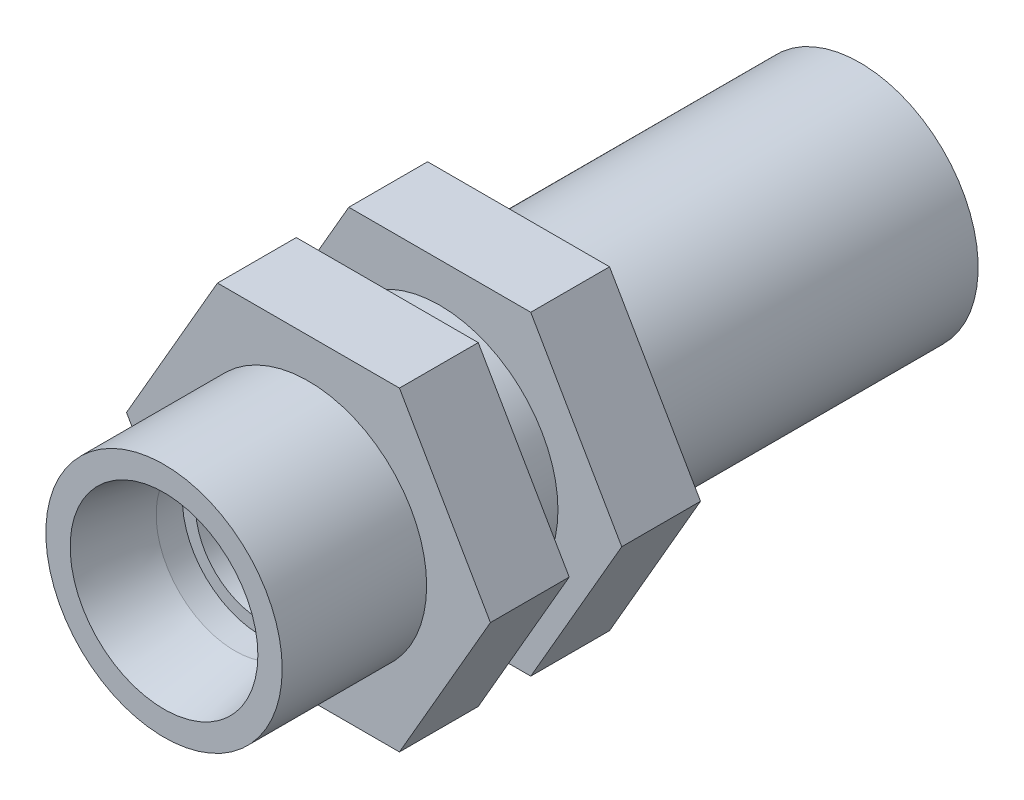
ISO-10303-21;
HEADER;
FILE_DESCRIPTION(('STEP AP214'),'2;1');
FILE_NAME('part.step','',(''),(''),'','','');
FILE_SCHEMA(('AUTOMOTIVE_DESIGN { 1 0 10303 214 1 1 1 1 }'));
ENDSEC;
DATA;
#1=APPLICATION_CONTEXT('core data for automotive mechanical design processes');
#2=APPLICATION_PROTOCOL_DEFINITION('international standard','automotive_design',2000,#1);
#3=PRODUCT_CONTEXT('',#1,'mechanical');
#4=PRODUCT('Part','Part','',(#3));
#5=PRODUCT_RELATED_PRODUCT_CATEGORY('part','',(#4));
#6=PRODUCT_DEFINITION_FORMATION('','',#4);
#7=PRODUCT_DEFINITION_CONTEXT('part definition',#1,'design');
#8=PRODUCT_DEFINITION('design','',#6,#7);
#9=PRODUCT_DEFINITION_SHAPE('','',#8);
#10=(LENGTH_UNIT() NAMED_UNIT(*) SI_UNIT(.MILLI.,.METRE.));
#11=(NAMED_UNIT(*) PLANE_ANGLE_UNIT() SI_UNIT($,.RADIAN.));
#12=(NAMED_UNIT(*) SI_UNIT($,.STERADIAN.) SOLID_ANGLE_UNIT());
#13=UNCERTAINTY_MEASURE_WITH_UNIT(LENGTH_MEASURE(1.E-05),#10,'distance_accuracy_value','');
#14=(GEOMETRIC_REPRESENTATION_CONTEXT(3) GLOBAL_UNCERTAINTY_ASSIGNED_CONTEXT((#13)) GLOBAL_UNIT_ASSIGNED_CONTEXT((#10,
#11,#12)) REPRESENTATION_CONTEXT('',''));
#15=CARTESIAN_POINT('',(0.,0.,0.));
#16=DIRECTION('',(0.,0.,1.));
#17=DIRECTION('',(1.,0.,0.));
#18=AXIS2_PLACEMENT_3D('',#15,#16,#17);
#19=CARTESIAN_POINT('',(0.,0.,17.));
#20=DIRECTION('',(0.,0.,1.));
#21=DIRECTION('',(1.,0.,0.));
#22=AXIS2_PLACEMENT_3D('',#19,#20,#21);
#23=PLANE('',#22);
#24=CARTESIAN_POINT('',(0.,0.,17.));
#25=DIRECTION('',(0.,0.,1.));
#26=DIRECTION('',(1.,0.,0.));
#27=AXIS2_PLACEMENT_3D('',#24,#25,#26);
#28=CIRCLE('',#27,9.);
#29=CARTESIAN_POINT('',(9.,0.,17.));
#30=VERTEX_POINT('',#29);
#31=EDGE_CURVE('E140',#30,#30,#28,.T.);
#32=ORIENTED_EDGE('',*,*,#31,.T.);
#33=EDGE_LOOP('',(#32));
#34=FACE_BOUND('',#33,.T.);
#35=CARTESIAN_POINT('',(0.,0.,17.));
#36=DIRECTION('',(0.,0.,1.));
#37=DIRECTION('',(1.,0.,0.));
#38=AXIS2_PLACEMENT_3D('',#35,#36,#37);
#39=CIRCLE('',#38,7.14780543301812);
#40=CARTESIAN_POINT('',(7.14780543301812,0.,17.));
#41=VERTEX_POINT('',#40);
#42=EDGE_CURVE('E256',#41,#41,#39,.T.);
#43=ORIENTED_EDGE('',*,*,#42,.F.);
#44=EDGE_LOOP('',(#43));
#45=FACE_BOUND('',#44,.T.);
#46=ADVANCED_FACE('F45',(#34,#45),#23,.T.);
#47=CARTESIAN_POINT('',(0.,0.,-36.));
#48=DIRECTION('',(0.,0.,-1.));
#49=DIRECTION('',(-1.,0.,0.));
#50=AXIS2_PLACEMENT_3D('',#47,#48,#49);
#51=PLANE('',#50);
#52=CARTESIAN_POINT('',(0.,0.,-36.));
#53=DIRECTION('',(0.,0.,-1.));
#54=DIRECTION('',(-1.,0.,0.));
#55=AXIS2_PLACEMENT_3D('',#52,#53,#54);
#56=CIRCLE('',#55,9.);
#57=CARTESIAN_POINT('',(-9.,0.,-36.));
#58=VERTEX_POINT('',#57);
#59=EDGE_CURVE('E213',#58,#58,#56,.T.);
#60=ORIENTED_EDGE('',*,*,#59,.T.);
#61=EDGE_LOOP('',(#60));
#62=FACE_BOUND('',#61,.T.);
#63=CARTESIAN_POINT('',(0.,0.,-36.));
#64=DIRECTION('',(0.,0.,1.));
#65=DIRECTION('',(1.,0.,0.));
#66=AXIS2_PLACEMENT_3D('',#63,#64,#65);
#67=CIRCLE('',#66,7.14780543301812);
#68=CARTESIAN_POINT('',(7.14780543301812,0.,-36.));
#69=VERTEX_POINT('',#68);
#70=EDGE_CURVE('E253',#69,#69,#67,.T.);
#71=ORIENTED_EDGE('',*,*,#70,.T.);
#72=EDGE_LOOP('',(#71));
#73=FACE_BOUND('',#72,.T.);
#74=ADVANCED_FACE('F264',(#62,#73),#51,.T.);
#75=CARTESIAN_POINT('',(-13.856406460551,0.,-10.));
#76=DIRECTION('',(0.,0.,-1.));
#77=DIRECTION('',(-1.,0.,0.));
#78=AXIS2_PLACEMENT_3D('',#75,#76,#77);
#79=PLANE('',#78);
#80=DIRECTION('',(-0.5,0.866025403784439,0.));
#81=VECTOR('',#80,1.);
#82=CARTESIAN_POINT('',(-6.92820323027551,-12.,-10.));
#83=LINE('',#82,#81);
#84=CARTESIAN_POINT('',(-6.92820323027551,-12.,-10.));
#85=VERTEX_POINT('',#84);
#86=CARTESIAN_POINT('',(-13.856406460551,0.,-10.));
#87=VERTEX_POINT('',#86);
#88=EDGE_CURVE('E197',#85,#87,#83,.T.);
#89=ORIENTED_EDGE('',*,*,#88,.T.);
#90=DIRECTION('',(0.5,0.866025403784438,0.));
#91=VECTOR('',#90,1.);
#92=CARTESIAN_POINT('',(-13.856406460551,0.,-10.));
#93=LINE('',#92,#91);
#94=CARTESIAN_POINT('',(-6.9282032302755,12.,-10.));
#95=VERTEX_POINT('',#94);
#96=EDGE_CURVE('E225',#87,#95,#93,.T.);
#97=ORIENTED_EDGE('',*,*,#96,.T.);
#98=DIRECTION('',(1.,0.,0.));
#99=VECTOR('',#98,1.);
#100=CARTESIAN_POINT('',(-6.9282032302755,12.,-10.));
#101=LINE('',#100,#99);
#102=CARTESIAN_POINT('',(6.92820323027551,12.,-10.));
#103=VERTEX_POINT('',#102);
#104=EDGE_CURVE('E222',#95,#103,#101,.T.);
#105=ORIENTED_EDGE('',*,*,#104,.T.);
#106=DIRECTION('',(0.5,-0.866025403784439,0.));
#107=VECTOR('',#106,1.);
#108=CARTESIAN_POINT('',(6.92820323027551,12.,-10.));
#109=LINE('',#108,#107);
#110=CARTESIAN_POINT('',(13.856406460551,0.,-10.));
#111=VERTEX_POINT('',#110);
#112=EDGE_CURVE('E219',#103,#111,#109,.T.);
#113=ORIENTED_EDGE('',*,*,#112,.T.);
#114=DIRECTION('',(-0.5,-0.866025403784438,0.));
#115=VECTOR('',#114,1.);
#116=CARTESIAN_POINT('',(13.856406460551,0.,-10.));
#117=LINE('',#116,#115);
#118=CARTESIAN_POINT('',(6.92820323027551,-12.,-10.));
#119=VERTEX_POINT('',#118);
#120=EDGE_CURVE('E216',#111,#119,#117,.T.);
#121=ORIENTED_EDGE('',*,*,#120,.T.);
#122=DIRECTION('',(-1.,0.,0.));
#123=VECTOR('',#122,1.);
#124=CARTESIAN_POINT('',(6.92820323027551,-12.,-10.));
#125=LINE('',#124,#123);
#126=EDGE_CURVE('E193',#119,#85,#125,.T.);
#127=ORIENTED_EDGE('',*,*,#126,.T.);
#128=EDGE_LOOP('',(#89,#97,#105,#113,#121,#127));
#129=FACE_BOUND('',#128,.T.);
#130=CARTESIAN_POINT('',(0.,0.,-10.));
#131=DIRECTION('',(0.,0.,-1.));
#132=DIRECTION('',(-1.,0.,0.));
#133=AXIS2_PLACEMENT_3D('',#130,#131,#132);
#134=CIRCLE('',#133,9.);
#135=CARTESIAN_POINT('',(-9.,0.,-10.));
#136=VERTEX_POINT('',#135);
#137=EDGE_CURVE('E230',#136,#136,#134,.T.);
#138=ORIENTED_EDGE('',*,*,#137,.F.);
#139=EDGE_LOOP('',(#138));
#140=FACE_BOUND('',#139,.T.);
#141=ADVANCED_FACE('F270',(#129,#140),#79,.T.);
#142=CARTESIAN_POINT('',(13.856406460551,0.,0.));
#143=DIRECTION('',(0.,0.,1.));
#144=DIRECTION('',(1.,0.,0.));
#145=AXIS2_PLACEMENT_3D('',#142,#143,#144);
#146=PLANE('',#145);
#147=DIRECTION('',(0.5,0.866025403784439,0.));
#148=VECTOR('',#147,1.);
#149=CARTESIAN_POINT('',(6.92820323027552,-12.,0.));
#150=LINE('',#149,#148);
#151=CARTESIAN_POINT('',(6.92820323027552,-12.,0.));
#152=VERTEX_POINT('',#151);
#153=CARTESIAN_POINT('',(13.856406460551,0.,0.));
#154=VERTEX_POINT('',#153);
#155=EDGE_CURVE('E136',#152,#154,#150,.T.);
#156=ORIENTED_EDGE('',*,*,#155,.F.);
#157=DIRECTION('',(1.,0.,0.));
#158=VECTOR('',#157,1.);
#159=CARTESIAN_POINT('',(-6.92820323027551,-12.,0.));
#160=LINE('',#159,#158);
#161=CARTESIAN_POINT('',(-6.92820323027551,-12.,0.));
#162=VERTEX_POINT('',#161);
#163=EDGE_CURVE('E92',#162,#152,#160,.T.);
#164=ORIENTED_EDGE('',*,*,#163,.F.);
#165=DIRECTION('',(0.5,-0.866025403784438,0.));
#166=VECTOR('',#165,1.);
#167=CARTESIAN_POINT('',(-13.856406460551,0.,0.));
#168=LINE('',#167,#166);
#169=CARTESIAN_POINT('',(-13.856406460551,0.,0.));
#170=VERTEX_POINT('',#169);
#171=EDGE_CURVE('E86',#170,#162,#168,.T.);
#172=ORIENTED_EDGE('',*,*,#171,.F.);
#173=DIRECTION('',(-0.5,-0.866025403784438,0.));
#174=VECTOR('',#173,1.);
#175=CARTESIAN_POINT('',(-6.92820323027551,12.,0.));
#176=LINE('',#175,#174);
#177=CARTESIAN_POINT('',(-6.92820323027551,12.,0.));
#178=VERTEX_POINT('',#177);
#179=EDGE_CURVE('E126',#178,#170,#176,.T.);
#180=ORIENTED_EDGE('',*,*,#179,.F.);
#181=DIRECTION('',(-1.,0.,0.));
#182=VECTOR('',#181,1.);
#183=CARTESIAN_POINT('',(6.92820323027551,12.,0.));
#184=LINE('',#183,#182);
#185=CARTESIAN_POINT('',(6.92820323027551,12.,0.));
#186=VERTEX_POINT('',#185);
#187=EDGE_CURVE('E142',#186,#178,#184,.T.);
#188=ORIENTED_EDGE('',*,*,#187,.F.);
#189=DIRECTION('',(-0.5,0.866025403784438,0.));
#190=VECTOR('',#189,1.);
#191=CARTESIAN_POINT('',(13.856406460551,0.,0.));
#192=LINE('',#191,#190);
#193=EDGE_CURVE('E139',#154,#186,#192,.T.);
#194=ORIENTED_EDGE('',*,*,#193,.F.);
#195=EDGE_LOOP('',(#156,#164,#172,#180,#188,#194));
#196=FACE_BOUND('',#195,.T.);
#197=CARTESIAN_POINT('',(0.,0.,0.));
#198=DIRECTION('',(0.,0.,1.));
#199=DIRECTION('',(1.,0.,0.));
#200=AXIS2_PLACEMENT_3D('',#197,#198,#199);
#201=CIRCLE('',#200,9.);
#202=CARTESIAN_POINT('',(9.,0.,0.));
#203=VERTEX_POINT('',#202);
#204=EDGE_CURVE('E11',#203,#203,#201,.F.);
#205=ORIENTED_EDGE('',*,*,#204,.F.);
#206=EDGE_LOOP('',(#205));
#207=FACE_BOUND('',#206,.T.);
#208=ADVANCED_FACE('F159',(#196,#207),#146,.F.);
#209=CARTESIAN_POINT('',(13.856406460551,0.,6.));
#210=DIRECTION('',(0.,0.,1.));
#211=DIRECTION('',(1.,0.,0.));
#212=AXIS2_PLACEMENT_3D('',#209,#210,#211);
#213=PLANE('',#212);
#214=DIRECTION('',(0.5,0.866025403784439,0.));
#215=VECTOR('',#214,1.);
#216=CARTESIAN_POINT('',(6.92820323027552,-12.,6.));
#217=LINE('',#216,#215);
#218=CARTESIAN_POINT('',(6.92820323027552,-12.,6.));
#219=VERTEX_POINT('',#218);
#220=CARTESIAN_POINT('',(13.856406460551,0.,6.));
#221=VERTEX_POINT('',#220);
#222=EDGE_CURVE('E147',#219,#221,#217,.T.);
#223=ORIENTED_EDGE('',*,*,#222,.T.);
#224=DIRECTION('',(-0.5,0.866025403784438,0.));
#225=VECTOR('',#224,1.);
#226=CARTESIAN_POINT('',(13.856406460551,0.,6.));
#227=LINE('',#226,#225);
#228=CARTESIAN_POINT('',(6.92820323027551,12.,6.));
#229=VERTEX_POINT('',#228);
#230=EDGE_CURVE('E101',#221,#229,#227,.T.);
#231=ORIENTED_EDGE('',*,*,#230,.T.);
#232=DIRECTION('',(-1.,0.,0.));
#233=VECTOR('',#232,1.);
#234=CARTESIAN_POINT('',(6.92820323027551,12.,6.));
#235=LINE('',#234,#233);
#236=CARTESIAN_POINT('',(-6.92820323027551,12.,6.));
#237=VERTEX_POINT('',#236);
#238=EDGE_CURVE('E118',#229,#237,#235,.T.);
#239=ORIENTED_EDGE('',*,*,#238,.T.);
#240=DIRECTION('',(-0.5,-0.866025403784438,0.));
#241=VECTOR('',#240,1.);
#242=CARTESIAN_POINT('',(-6.92820323027551,12.,6.));
#243=LINE('',#242,#241);
#244=CARTESIAN_POINT('',(-13.856406460551,0.,6.));
#245=VERTEX_POINT('',#244);
#246=EDGE_CURVE('E111',#237,#245,#243,.T.);
#247=ORIENTED_EDGE('',*,*,#246,.T.);
#248=DIRECTION('',(0.5,-0.866025403784438,0.));
#249=VECTOR('',#248,1.);
#250=CARTESIAN_POINT('',(-13.856406460551,0.,6.));
#251=LINE('',#250,#249);
#252=CARTESIAN_POINT('',(-6.92820323027551,-12.,6.));
#253=VERTEX_POINT('',#252);
#254=EDGE_CURVE('E116',#245,#253,#251,.T.);
#255=ORIENTED_EDGE('',*,*,#254,.T.);
#256=DIRECTION('',(1.,0.,0.));
#257=VECTOR('',#256,1.);
#258=CARTESIAN_POINT('',(-6.92820323027551,-12.,6.));
#259=LINE('',#258,#257);
#260=EDGE_CURVE('E62',#253,#219,#259,.T.);
#261=ORIENTED_EDGE('',*,*,#260,.T.);
#262=EDGE_LOOP('',(#223,#231,#239,#247,#255,#261));
#263=FACE_BOUND('',#262,.T.);
#264=CARTESIAN_POINT('',(0.,0.,6.));
#265=DIRECTION('',(0.,0.,1.));
#266=DIRECTION('',(1.,0.,0.));
#267=AXIS2_PLACEMENT_3D('',#264,#265,#266);
#268=CIRCLE('',#267,9.);
#269=CARTESIAN_POINT('',(9.,0.,6.));
#270=VERTEX_POINT('',#269);
#271=EDGE_CURVE('E167',#270,#270,#268,.T.);
#272=ORIENTED_EDGE('',*,*,#271,.F.);
#273=EDGE_LOOP('',(#272));
#274=FACE_BOUND('',#273,.T.);
#275=ADVANCED_FACE('F113',(#263,#274),#213,.T.);
#276=CARTESIAN_POINT('',(6.92820323027552,-12.,6.));
#277=DIRECTION('',(-0.866025403784439,0.5,0.));
#278=DIRECTION('',(-0.5,-0.866025403784439,0.));
#279=AXIS2_PLACEMENT_3D('',#276,#277,#278);
#280=PLANE('',#279);
#281=ORIENTED_EDGE('',*,*,#155,.T.);
#282=DIRECTION('',(0.,0.,-1.));
#283=VECTOR('',#282,1.);
#284=CARTESIAN_POINT('',(13.856406460551,0.,6.));
#285=LINE('',#284,#283);
#286=EDGE_CURVE('E54',#221,#154,#285,.T.);
#287=ORIENTED_EDGE('',*,*,#286,.F.);
#288=ORIENTED_EDGE('',*,*,#222,.F.);
#289=DIRECTION('',(0.,0.,-1.));
#290=VECTOR('',#289,1.);
#291=CARTESIAN_POINT('',(6.92820323027552,-12.,6.));
#292=LINE('',#291,#290);
#293=EDGE_CURVE('E132',#219,#152,#292,.T.);
#294=ORIENTED_EDGE('',*,*,#293,.T.);
#295=EDGE_LOOP('',(#281,#287,#288,#294));
#296=FACE_BOUND('',#295,.T.);
#297=ADVANCED_FACE('F47',(#296),#280,.F.);
#298=CARTESIAN_POINT('',(13.856406460551,0.,6.));
#299=DIRECTION('',(-0.866025403784438,-0.5,0.));
#300=DIRECTION('',(0.5,-0.866025403784438,0.));
#301=AXIS2_PLACEMENT_3D('',#298,#299,#300);
#302=PLANE('',#301);
#303=ORIENTED_EDGE('',*,*,#193,.T.);
#304=DIRECTION('',(0.,0.,-1.));
#305=VECTOR('',#304,1.);
#306=CARTESIAN_POINT('',(6.92820323027551,12.,6.));
#307=LINE('',#306,#305);
#308=EDGE_CURVE('E151',#229,#186,#307,.T.);
#309=ORIENTED_EDGE('',*,*,#308,.F.);
#310=ORIENTED_EDGE('',*,*,#230,.F.);
#311=ORIENTED_EDGE('',*,*,#286,.T.);
#312=EDGE_LOOP('',(#303,#309,#310,#311));
#313=FACE_BOUND('',#312,.T.);
#314=ADVANCED_FACE('F154',(#313),#302,.F.);
#315=CARTESIAN_POINT('',(6.92820323027551,12.,6.));
#316=DIRECTION('',(0.,-1.,0.));
#317=DIRECTION('',(1.,0.,0.));
#318=AXIS2_PLACEMENT_3D('',#315,#316,#317);
#319=PLANE('',#318);
#320=ORIENTED_EDGE('',*,*,#187,.T.);
#321=DIRECTION('',(0.,0.,-1.));
#322=VECTOR('',#321,1.);
#323=CARTESIAN_POINT('',(-6.92820323027551,12.,6.));
#324=LINE('',#323,#322);
#325=EDGE_CURVE('E127',#237,#178,#324,.T.);
#326=ORIENTED_EDGE('',*,*,#325,.F.);
#327=ORIENTED_EDGE('',*,*,#238,.F.);
#328=ORIENTED_EDGE('',*,*,#308,.T.);
#329=EDGE_LOOP('',(#320,#326,#327,#328));
#330=FACE_BOUND('',#329,.T.);
#331=ADVANCED_FACE('F163',(#330),#319,.F.);
#332=CARTESIAN_POINT('',(-6.92820323027551,12.,6.));
#333=DIRECTION('',(0.866025403784439,-0.5,0.));
#334=DIRECTION('',(0.5,0.866025403784439,0.));
#335=AXIS2_PLACEMENT_3D('',#332,#333,#334);
#336=PLANE('',#335);
#337=ORIENTED_EDGE('',*,*,#179,.T.);
#338=DIRECTION('',(0.,0.,-1.));
#339=VECTOR('',#338,1.);
#340=CARTESIAN_POINT('',(-13.856406460551,0.,6.));
#341=LINE('',#340,#339);
#342=EDGE_CURVE('E123',#245,#170,#341,.T.);
#343=ORIENTED_EDGE('',*,*,#342,.F.);
#344=ORIENTED_EDGE('',*,*,#246,.F.);
#345=ORIENTED_EDGE('',*,*,#325,.T.);
#346=EDGE_LOOP('',(#337,#343,#344,#345));
#347=FACE_BOUND('',#346,.T.);
#348=ADVANCED_FACE('F124',(#347),#336,.F.);
#349=CARTESIAN_POINT('',(-13.856406460551,0.,6.));
#350=DIRECTION('',(0.866025403784439,0.5,0.));
#351=DIRECTION('',(-0.5,0.866025403784439,0.));
#352=AXIS2_PLACEMENT_3D('',#349,#350,#351);
#353=PLANE('',#352);
#354=ORIENTED_EDGE('',*,*,#171,.T.);
#355=DIRECTION('',(0.,0.,-1.));
#356=VECTOR('',#355,1.);
#357=CARTESIAN_POINT('',(-6.92820323027551,-12.,6.));
#358=LINE('',#357,#356);
#359=EDGE_CURVE('E128',#253,#162,#358,.T.);
#360=ORIENTED_EDGE('',*,*,#359,.F.);
#361=ORIENTED_EDGE('',*,*,#254,.F.);
#362=ORIENTED_EDGE('',*,*,#342,.T.);
#363=EDGE_LOOP('',(#354,#360,#361,#362));
#364=FACE_BOUND('',#363,.T.);
#365=ADVANCED_FACE('F130',(#364),#353,.F.);
#366=CARTESIAN_POINT('',(-6.92820323027551,-12.,6.));
#367=DIRECTION('',(0.,1.,0.));
#368=DIRECTION('',(-1.,0.,0.));
#369=AXIS2_PLACEMENT_3D('',#366,#367,#368);
#370=PLANE('',#369);
#371=ORIENTED_EDGE('',*,*,#163,.T.);
#372=ORIENTED_EDGE('',*,*,#293,.F.);
#373=ORIENTED_EDGE('',*,*,#260,.F.);
#374=ORIENTED_EDGE('',*,*,#359,.T.);
#375=EDGE_LOOP('',(#371,#372,#373,#374));
#376=FACE_BOUND('',#375,.T.);
#377=ADVANCED_FACE('F280',(#376),#370,.F.);
#378=CARTESIAN_POINT('',(0.,0.,17.));
#379=DIRECTION('',(0.,0.,-1.));
#380=DIRECTION('',(-1.,0.,0.));
#381=AXIS2_PLACEMENT_3D('',#378,#379,#380);
#382=CYLINDRICAL_SURFACE('',#381,9.);
#383=ORIENTED_EDGE('',*,*,#31,.F.);
#384=EDGE_LOOP('',(#383));
#385=FACE_BOUND('',#384,.T.);
#386=ORIENTED_EDGE('',*,*,#271,.T.);
#387=EDGE_LOOP('',(#386));
#388=FACE_BOUND('',#387,.T.);
#389=ADVANCED_FACE('F277',(#385,#388),#382,.T.);
#390=CARTESIAN_POINT('',(0.,0.,-4.));
#391=DIRECTION('',(0.,0.,1.));
#392=DIRECTION('',(1.,0.,0.));
#393=AXIS2_PLACEMENT_3D('',#390,#391,#392);
#394=CYLINDRICAL_SURFACE('',#393,9.);
#395=CARTESIAN_POINT('',(0.,0.,-4.));
#396=DIRECTION('',(0.,0.,-1.));
#397=DIRECTION('',(-1.,0.,0.));
#398=AXIS2_PLACEMENT_3D('',#395,#396,#397);
#399=CIRCLE('',#398,9.);
#400=CARTESIAN_POINT('',(-9.,0.,-4.));
#401=VERTEX_POINT('',#400);
#402=EDGE_CURVE('E170',#401,#401,#399,.T.);
#403=ORIENTED_EDGE('',*,*,#402,.F.);
#404=EDGE_LOOP('',(#403));
#405=FACE_BOUND('',#404,.T.);
#406=ORIENTED_EDGE('',*,*,#204,.T.);
#407=EDGE_LOOP('',(#406));
#408=FACE_BOUND('',#407,.T.);
#409=ADVANCED_FACE('F275',(#405,#408),#394,.T.);
#410=CARTESIAN_POINT('',(-13.856406460551,0.,-4.));
#411=DIRECTION('',(0.,0.,-1.));
#412=DIRECTION('',(-1.,0.,0.));
#413=AXIS2_PLACEMENT_3D('',#410,#411,#412);
#414=PLANE('',#413);
#415=DIRECTION('',(-0.5,0.866025403784439,0.));
#416=VECTOR('',#415,1.);
#417=CARTESIAN_POINT('',(-6.92820323027551,-12.,-4.));
#418=LINE('',#417,#416);
#419=CARTESIAN_POINT('',(-6.92820323027551,-12.,-4.));
#420=VERTEX_POINT('',#419);
#421=CARTESIAN_POINT('',(-13.856406460551,0.,-4.));
#422=VERTEX_POINT('',#421);
#423=EDGE_CURVE('E210',#420,#422,#418,.T.);
#424=ORIENTED_EDGE('',*,*,#423,.F.);
#425=DIRECTION('',(-1.,0.,0.));
#426=VECTOR('',#425,1.);
#427=CARTESIAN_POINT('',(6.92820323027551,-12.,-4.));
#428=LINE('',#427,#426);
#429=CARTESIAN_POINT('',(6.92820323027551,-12.,-4.));
#430=VERTEX_POINT('',#429);
#431=EDGE_CURVE('E194',#430,#420,#428,.T.);
#432=ORIENTED_EDGE('',*,*,#431,.F.);
#433=DIRECTION('',(-0.5,-0.866025403784438,0.));
#434=VECTOR('',#433,1.);
#435=CARTESIAN_POINT('',(13.856406460551,0.,-4.));
#436=LINE('',#435,#434);
#437=CARTESIAN_POINT('',(13.856406460551,0.,-4.));
#438=VERTEX_POINT('',#437);
#439=EDGE_CURVE('E198',#438,#430,#436,.T.);
#440=ORIENTED_EDGE('',*,*,#439,.F.);
#441=DIRECTION('',(0.5,-0.866025403784439,0.));
#442=VECTOR('',#441,1.);
#443=CARTESIAN_POINT('',(6.92820323027551,12.,-4.));
#444=LINE('',#443,#442);
#445=CARTESIAN_POINT('',(6.92820323027551,12.,-4.));
#446=VERTEX_POINT('',#445);
#447=EDGE_CURVE('E201',#446,#438,#444,.T.);
#448=ORIENTED_EDGE('',*,*,#447,.F.);
#449=DIRECTION('',(1.,0.,0.));
#450=VECTOR('',#449,1.);
#451=CARTESIAN_POINT('',(-6.9282032302755,12.,-4.));
#452=LINE('',#451,#450);
#453=CARTESIAN_POINT('',(-6.9282032302755,12.,-4.));
#454=VERTEX_POINT('',#453);
#455=EDGE_CURVE('E204',#454,#446,#452,.T.);
#456=ORIENTED_EDGE('',*,*,#455,.F.);
#457=DIRECTION('',(0.5,0.866025403784438,0.));
#458=VECTOR('',#457,1.);
#459=CARTESIAN_POINT('',(-13.856406460551,0.,-4.));
#460=LINE('',#459,#458);
#461=EDGE_CURVE('E207',#422,#454,#460,.T.);
#462=ORIENTED_EDGE('',*,*,#461,.F.);
#463=EDGE_LOOP('',(#424,#432,#440,#448,#456,#462));
#464=FACE_BOUND('',#463,.T.);
#465=ORIENTED_EDGE('',*,*,#402,.T.);
#466=EDGE_LOOP('',(#465));
#467=FACE_BOUND('',#466,.T.);
#468=ADVANCED_FACE('F408',(#464,#467),#414,.F.);
#469=CARTESIAN_POINT('',(-6.92820323027551,-12.,-10.));
#470=DIRECTION('',(0.866025403784439,0.5,0.));
#471=DIRECTION('',(-0.5,0.866025403784439,0.));
#472=AXIS2_PLACEMENT_3D('',#469,#470,#471);
#473=PLANE('',#472);
#474=ORIENTED_EDGE('',*,*,#423,.T.);
#475=DIRECTION('',(0.,0.,1.));
#476=VECTOR('',#475,1.);
#477=CARTESIAN_POINT('',(-13.856406460551,0.,-10.));
#478=LINE('',#477,#476);
#479=EDGE_CURVE('E175',#87,#422,#478,.T.);
#480=ORIENTED_EDGE('',*,*,#479,.F.);
#481=ORIENTED_EDGE('',*,*,#88,.F.);
#482=DIRECTION('',(0.,0.,1.));
#483=VECTOR('',#482,1.);
#484=CARTESIAN_POINT('',(-6.92820323027551,-12.,-10.));
#485=LINE('',#484,#483);
#486=EDGE_CURVE('E190',#85,#420,#485,.T.);
#487=ORIENTED_EDGE('',*,*,#486,.T.);
#488=EDGE_LOOP('',(#474,#480,#481,#487));
#489=FACE_BOUND('',#488,.T.);
#490=ADVANCED_FACE('F397',(#489),#473,.F.);
#491=CARTESIAN_POINT('',(-13.856406460551,0.,-10.));
#492=DIRECTION('',(0.866025403784438,-0.5,0.));
#493=DIRECTION('',(0.5,0.866025403784438,0.));
#494=AXIS2_PLACEMENT_3D('',#491,#492,#493);
#495=PLANE('',#494);
#496=ORIENTED_EDGE('',*,*,#461,.T.);
#497=DIRECTION('',(0.,0.,1.));
#498=VECTOR('',#497,1.);
#499=CARTESIAN_POINT('',(-6.9282032302755,12.,-10.));
#500=LINE('',#499,#498);
#501=EDGE_CURVE('E178',#95,#454,#500,.T.);
#502=ORIENTED_EDGE('',*,*,#501,.F.);
#503=ORIENTED_EDGE('',*,*,#96,.F.);
#504=ORIENTED_EDGE('',*,*,#479,.T.);
#505=EDGE_LOOP('',(#496,#502,#503,#504));
#506=FACE_BOUND('',#505,.T.);
#507=ADVANCED_FACE('F386',(#506),#495,.F.);
#508=CARTESIAN_POINT('',(-6.9282032302755,12.,-10.));
#509=DIRECTION('',(0.,-1.,0.));
#510=DIRECTION('',(0.,0.,-1.));
#511=AXIS2_PLACEMENT_3D('',#508,#509,#510);
#512=PLANE('',#511);
#513=ORIENTED_EDGE('',*,*,#455,.T.);
#514=DIRECTION('',(0.,0.,1.));
#515=VECTOR('',#514,1.);
#516=CARTESIAN_POINT('',(6.92820323027551,12.,-10.));
#517=LINE('',#516,#515);
#518=EDGE_CURVE('E181',#103,#446,#517,.T.);
#519=ORIENTED_EDGE('',*,*,#518,.F.);
#520=ORIENTED_EDGE('',*,*,#104,.F.);
#521=ORIENTED_EDGE('',*,*,#501,.T.);
#522=EDGE_LOOP('',(#513,#519,#520,#521));
#523=FACE_BOUND('',#522,.T.);
#524=ADVANCED_FACE('F375',(#523),#512,.F.);
#525=CARTESIAN_POINT('',(6.92820323027551,12.,-10.));
#526=DIRECTION('',(-0.866025403784439,-0.5,0.));
#527=DIRECTION('',(0.5,-0.866025403784439,0.));
#528=AXIS2_PLACEMENT_3D('',#525,#526,#527);
#529=PLANE('',#528);
#530=ORIENTED_EDGE('',*,*,#447,.T.);
#531=DIRECTION('',(0.,0.,1.));
#532=VECTOR('',#531,1.);
#533=CARTESIAN_POINT('',(13.856406460551,0.,-10.));
#534=LINE('',#533,#532);
#535=EDGE_CURVE('E184',#111,#438,#534,.T.);
#536=ORIENTED_EDGE('',*,*,#535,.F.);
#537=ORIENTED_EDGE('',*,*,#112,.F.);
#538=ORIENTED_EDGE('',*,*,#518,.T.);
#539=EDGE_LOOP('',(#530,#536,#537,#538));
#540=FACE_BOUND('',#539,.T.);
#541=ADVANCED_FACE('F364',(#540),#529,.F.);
#542=CARTESIAN_POINT('',(13.856406460551,0.,-10.));
#543=DIRECTION('',(-0.866025403784439,0.5,0.));
#544=DIRECTION('',(-0.5,-0.866025403784439,0.));
#545=AXIS2_PLACEMENT_3D('',#542,#543,#544);
#546=PLANE('',#545);
#547=ORIENTED_EDGE('',*,*,#439,.T.);
#548=DIRECTION('',(0.,0.,1.));
#549=VECTOR('',#548,1.);
#550=CARTESIAN_POINT('',(6.92820323027551,-12.,-10.));
#551=LINE('',#550,#549);
#552=EDGE_CURVE('E187',#119,#430,#551,.T.);
#553=ORIENTED_EDGE('',*,*,#552,.F.);
#554=ORIENTED_EDGE('',*,*,#120,.F.);
#555=ORIENTED_EDGE('',*,*,#535,.T.);
#556=EDGE_LOOP('',(#547,#553,#554,#555));
#557=FACE_BOUND('',#556,.T.);
#558=ADVANCED_FACE('F353',(#557),#546,.F.);
#559=CARTESIAN_POINT('',(6.92820323027551,-12.,-10.));
#560=DIRECTION('',(0.,1.,0.));
#561=DIRECTION('',(-1.,0.,0.));
#562=AXIS2_PLACEMENT_3D('',#559,#560,#561);
#563=PLANE('',#562);
#564=ORIENTED_EDGE('',*,*,#431,.T.);
#565=ORIENTED_EDGE('',*,*,#486,.F.);
#566=ORIENTED_EDGE('',*,*,#126,.F.);
#567=ORIENTED_EDGE('',*,*,#552,.T.);
#568=EDGE_LOOP('',(#564,#565,#566,#567));
#569=FACE_BOUND('',#568,.T.);
#570=ADVANCED_FACE('F336',(#569),#563,.F.);
#571=CARTESIAN_POINT('',(0.,0.,-36.));
#572=DIRECTION('',(0.,0.,1.));
#573=DIRECTION('',(1.,0.,0.));
#574=AXIS2_PLACEMENT_3D('',#571,#572,#573);
#575=CYLINDRICAL_SURFACE('',#574,9.);
#576=ORIENTED_EDGE('',*,*,#59,.F.);
#577=EDGE_LOOP('',(#576));
#578=FACE_BOUND('',#577,.T.);
#579=ORIENTED_EDGE('',*,*,#137,.T.);
#580=EDGE_LOOP('',(#579));
#581=FACE_BOUND('',#580,.T.);
#582=ADVANCED_FACE('F331',(#578,#581),#575,.T.);
#583=CARTESIAN_POINT('',(0.,0.,11.6));
#584=DIRECTION('',(0.,0.,1.));
#585=DIRECTION('',(1.,0.,0.));
#586=AXIS2_PLACEMENT_3D('',#583,#584,#585);
#587=CONICAL_SURFACE('',#586,5.99999999999999,0.20943951023932);
#588=ORIENTED_EDGE('',*,*,#42,.T.);
#589=EDGE_LOOP('',(#588));
#590=FACE_BOUND('',#589,.T.);
#591=CARTESIAN_POINT('',(0.,0.,11.6));
#592=DIRECTION('',(0.,0.,1.));
#593=DIRECTION('',(1.,0.,0.));
#594=AXIS2_PLACEMENT_3D('',#591,#592,#593);
#595=CIRCLE('',#594,5.99999999999999);
#596=CARTESIAN_POINT('',(5.99999999999999,0.,11.6));
#597=VERTEX_POINT('',#596);
#598=EDGE_CURVE('E233',#597,#597,#595,.T.);
#599=ORIENTED_EDGE('',*,*,#598,.F.);
#600=EDGE_LOOP('',(#599));
#601=FACE_BOUND('',#600,.T.);
#602=ADVANCED_FACE('F260',(#590,#601),#587,.F.);
#603=CARTESIAN_POINT('',(0.,0.,19.));
#604=DIRECTION('',(0.,0.,1.));
#605=DIRECTION('',(1.,0.,0.));
#606=AXIS2_PLACEMENT_3D('',#603,#604,#605);
#607=CYLINDRICAL_SURFACE('',#606,5.99999999999999);
#608=ORIENTED_EDGE('',*,*,#598,.T.);
#609=EDGE_LOOP('',(#608));
#610=FACE_BOUND('',#609,.T.);
#611=CARTESIAN_POINT('',(0.,0.,9.6));
#612=DIRECTION('',(0.,0.,1.));
#613=DIRECTION('',(1.,0.,0.));
#614=AXIS2_PLACEMENT_3D('',#611,#612,#613);
#615=CIRCLE('',#614,5.99999999999999);
#616=CARTESIAN_POINT('',(5.99999999999999,0.,9.6));
#617=VERTEX_POINT('',#616);
#618=EDGE_CURVE('E238',#617,#617,#615,.T.);
#619=ORIENTED_EDGE('',*,*,#618,.F.);
#620=EDGE_LOOP('',(#619));
#621=FACE_BOUND('',#620,.T.);
#622=ADVANCED_FACE('F501',(#610,#621),#607,.F.);
#623=CARTESIAN_POINT('',(0.,5.99999999999999,9.6));
#624=DIRECTION('',(0.,0.,1.));
#625=DIRECTION('',(1.,0.,0.));
#626=AXIS2_PLACEMENT_3D('',#623,#624,#625);
#627=PLANE('',#626);
#628=ORIENTED_EDGE('',*,*,#618,.T.);
#629=EDGE_LOOP('',(#628));
#630=FACE_BOUND('',#629,.T.);
#631=CARTESIAN_POINT('',(0.,0.,9.6));
#632=DIRECTION('',(0.,0.,1.));
#633=DIRECTION('',(1.,0.,0.));
#634=AXIS2_PLACEMENT_3D('',#631,#632,#633);
#635=CIRCLE('',#634,5.);
#636=CARTESIAN_POINT('',(5.,0.,9.6));
#637=VERTEX_POINT('',#636);
#638=EDGE_CURVE('E241',#637,#637,#635,.T.);
#639=ORIENTED_EDGE('',*,*,#638,.F.);
#640=EDGE_LOOP('',(#639));
#641=FACE_BOUND('',#640,.T.);
#642=ADVANCED_FACE('F507',(#630,#641),#627,.T.);
#643=CARTESIAN_POINT('',(0.,0.,19.));
#644=DIRECTION('',(0.,0.,1.));
#645=DIRECTION('',(1.,0.,0.));
#646=AXIS2_PLACEMENT_3D('',#643,#644,#645);
#647=CYLINDRICAL_SURFACE('',#646,5.);
#648=ORIENTED_EDGE('',*,*,#638,.T.);
#649=EDGE_LOOP('',(#648));
#650=FACE_BOUND('',#649,.T.);
#651=CARTESIAN_POINT('',(0.,0.,-28.6));
#652=DIRECTION('',(0.,0.,1.));
#653=DIRECTION('',(1.,0.,0.));
#654=AXIS2_PLACEMENT_3D('',#651,#652,#653);
#655=CIRCLE('',#654,5.);
#656=CARTESIAN_POINT('',(5.,0.,-28.6));
#657=VERTEX_POINT('',#656);
#658=EDGE_CURVE('E244',#657,#657,#655,.T.);
#659=ORIENTED_EDGE('',*,*,#658,.F.);
#660=EDGE_LOOP('',(#659));
#661=FACE_BOUND('',#660,.T.);
#662=ADVANCED_FACE('F515',(#650,#661),#647,.F.);
#663=CARTESIAN_POINT('',(0.,6.,-28.6));
#664=DIRECTION('',(0.,0.,-1.));
#665=DIRECTION('',(-1.,0.,0.));
#666=AXIS2_PLACEMENT_3D('',#663,#664,#665);
#667=PLANE('',#666);
#668=ORIENTED_EDGE('',*,*,#658,.T.);
#669=EDGE_LOOP('',(#668));
#670=FACE_BOUND('',#669,.T.);
#671=CARTESIAN_POINT('',(0.,0.,-28.6));
#672=DIRECTION('',(0.,0.,1.));
#673=DIRECTION('',(1.,0.,0.));
#674=AXIS2_PLACEMENT_3D('',#671,#672,#673);
#675=CIRCLE('',#674,6.);
#676=CARTESIAN_POINT('',(6.,0.,-28.6));
#677=VERTEX_POINT('',#676);
#678=EDGE_CURVE('E247',#677,#677,#675,.T.);
#679=ORIENTED_EDGE('',*,*,#678,.F.);
#680=EDGE_LOOP('',(#679));
#681=FACE_BOUND('',#680,.T.);
#682=ADVANCED_FACE('F523',(#670,#681),#667,.T.);
#683=CARTESIAN_POINT('',(0.,0.,19.));
#684=DIRECTION('',(0.,0.,1.));
#685=DIRECTION('',(1.,0.,0.));
#686=AXIS2_PLACEMENT_3D('',#683,#684,#685);
#687=CYLINDRICAL_SURFACE('',#686,6.);
#688=ORIENTED_EDGE('',*,*,#678,.T.);
#689=EDGE_LOOP('',(#688));
#690=FACE_BOUND('',#689,.T.);
#691=CARTESIAN_POINT('',(0.,0.,-30.6));
#692=DIRECTION('',(0.,0.,1.));
#693=DIRECTION('',(1.,0.,0.));
#694=AXIS2_PLACEMENT_3D('',#691,#692,#693);
#695=CIRCLE('',#694,6.);
#696=CARTESIAN_POINT('',(6.,0.,-30.6));
#697=VERTEX_POINT('',#696);
#698=EDGE_CURVE('E250',#697,#697,#695,.T.);
#699=ORIENTED_EDGE('',*,*,#698,.F.);
#700=EDGE_LOOP('',(#699));
#701=FACE_BOUND('',#700,.T.);
#702=ADVANCED_FACE('F531',(#690,#701),#687,.F.);
#703=CARTESIAN_POINT('',(0.,0.,-36.));
#704=DIRECTION('',(0.,0.,-1.));
#705=DIRECTION('',(-1.,0.,0.));
#706=AXIS2_PLACEMENT_3D('',#703,#704,#705);
#707=CONICAL_SURFACE('',#706,7.14780543301812,0.20943951023932);
#708=ORIENTED_EDGE('',*,*,#698,.T.);
#709=EDGE_LOOP('',(#708));
#710=FACE_BOUND('',#709,.T.);
#711=ORIENTED_EDGE('',*,*,#70,.F.);
#712=EDGE_LOOP('',(#711));
#713=FACE_BOUND('',#712,.T.);
#714=ADVANCED_FACE('F539',(#710,#713),#707,.F.);
#715=CLOSED_SHELL('',(#46,#74,#141,#208,#275,#297,#314,#331,#348,#365,#377,#389,#409,#468,#490,
#507,#524,#541,#558,#570,#582,#602,#622,#642,#662,#682,#702,#714));
#716=MANIFOLD_SOLID_BREP('B2',#715);
#717=ADVANCED_BREP_SHAPE_REPRESENTATION('',(#18,#716),#14);
#718=SHAPE_DEFINITION_REPRESENTATION(#9,#717);
ENDSEC;
END-ISO-10303-21;
